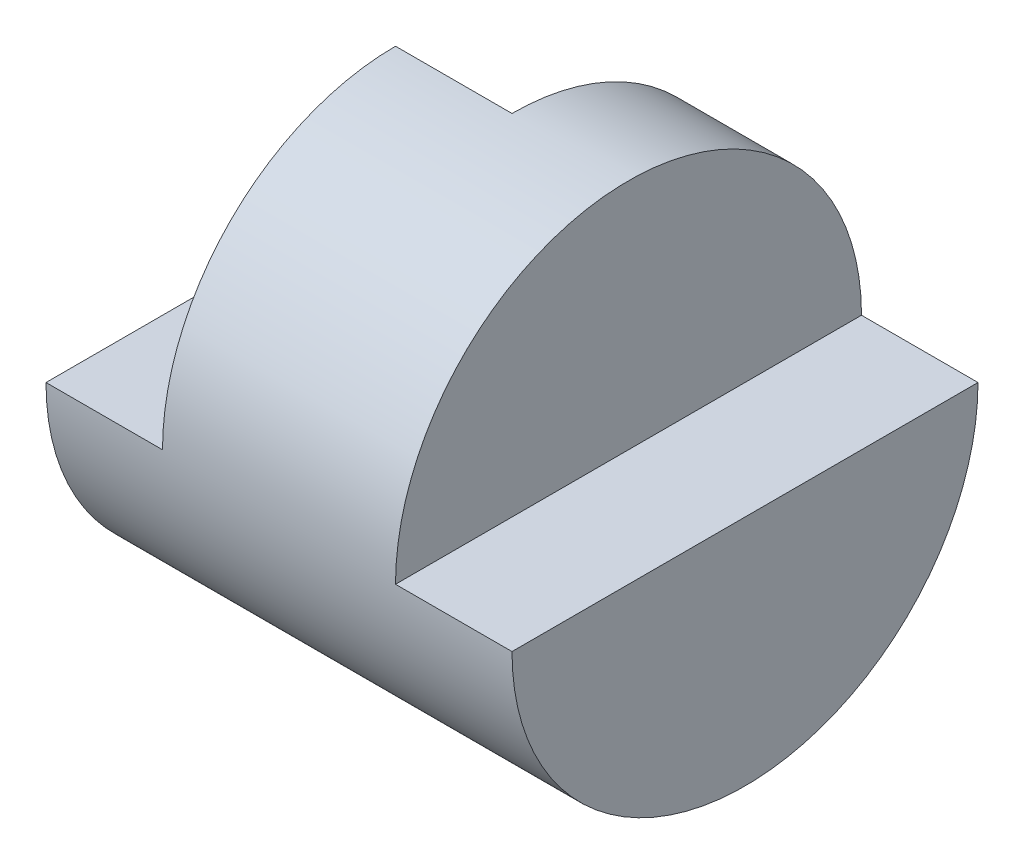
ISO-10303-21;
HEADER;
FILE_DESCRIPTION(('STEP AP214'),'2;1');
FILE_NAME('part.step','',(''),(''),'','','');
FILE_SCHEMA(('AUTOMOTIVE_DESIGN { 1 0 10303 214 1 1 1 1 }'));
ENDSEC;
DATA;
#1=APPLICATION_CONTEXT('core data for automotive mechanical design processes');
#2=APPLICATION_PROTOCOL_DEFINITION('international standard','automotive_design',2000,#1);
#3=PRODUCT_CONTEXT('',#1,'mechanical');
#4=PRODUCT('Part','Part','',(#3));
#5=PRODUCT_RELATED_PRODUCT_CATEGORY('part','',(#4));
#6=PRODUCT_DEFINITION_FORMATION('','',#4);
#7=PRODUCT_DEFINITION_CONTEXT('part definition',#1,'design');
#8=PRODUCT_DEFINITION('design','',#6,#7);
#9=PRODUCT_DEFINITION_SHAPE('','',#8);
#10=(LENGTH_UNIT() NAMED_UNIT(*) SI_UNIT(.MILLI.,.METRE.));
#11=(NAMED_UNIT(*) PLANE_ANGLE_UNIT() SI_UNIT($,.RADIAN.));
#12=(NAMED_UNIT(*) SI_UNIT($,.STERADIAN.) SOLID_ANGLE_UNIT());
#13=UNCERTAINTY_MEASURE_WITH_UNIT(LENGTH_MEASURE(1.E-05),#10,'distance_accuracy_value','');
#14=(GEOMETRIC_REPRESENTATION_CONTEXT(3) GLOBAL_UNCERTAINTY_ASSIGNED_CONTEXT((#13)) GLOBAL_UNIT_ASSIGNED_CONTEXT((#10,
#11,#12)) REPRESENTATION_CONTEXT('',''));
#15=CARTESIAN_POINT('',(0.,0.,0.));
#16=DIRECTION('',(0.,0.,1.));
#17=DIRECTION('',(1.,0.,0.));
#18=AXIS2_PLACEMENT_3D('',#15,#16,#17);
#19=CARTESIAN_POINT('',(0.,0.,0.));
#20=DIRECTION('',(-1.,0.,0.));
#21=DIRECTION('',(0.,0.,1.));
#22=AXIS2_PLACEMENT_3D('',#19,#20,#21);
#23=CYLINDRICAL_SURFACE('',#22,2.);
#24=CARTESIAN_POINT('',(3.,0.,0.));
#25=DIRECTION('',(-1.,0.,0.));
#26=DIRECTION('',(0.,-1.,0.));
#27=AXIS2_PLACEMENT_3D('',#24,#25,#26);
#28=CIRCLE('',#27,2.);
#29=CARTESIAN_POINT('',(3.,0.,-2.));
#30=VERTEX_POINT('',#29);
#31=CARTESIAN_POINT('',(3.,0.,2.));
#32=VERTEX_POINT('',#31);
#33=EDGE_CURVE('E125',#30,#32,#28,.F.);
#34=ORIENTED_EDGE('',*,*,#33,.F.);
#35=DIRECTION('',(-1.,0.,0.));
#36=VECTOR('',#35,1.);
#37=CARTESIAN_POINT('',(0.,0.,-2.));
#38=LINE('',#37,#36);
#39=CARTESIAN_POINT('',(4.,0.,-2.));
#40=VERTEX_POINT('',#39);
#41=EDGE_CURVE('E114',#30,#40,#38,.F.);
#42=ORIENTED_EDGE('',*,*,#41,.T.);
#43=CARTESIAN_POINT('',(4.,0.,0.));
#44=DIRECTION('',(-1.,0.,0.));
#45=DIRECTION('',(0.,0.,1.));
#46=AXIS2_PLACEMENT_3D('',#43,#44,#45);
#47=CIRCLE('',#46,2.);
#48=CARTESIAN_POINT('',(4.,0.,2.));
#49=VERTEX_POINT('',#48);
#50=EDGE_CURVE('E117',#40,#49,#47,.T.);
#51=ORIENTED_EDGE('',*,*,#50,.T.);
#52=DIRECTION('',(-1.,0.,0.));
#53=VECTOR('',#52,1.);
#54=CARTESIAN_POINT('',(0.,0.,2.));
#55=LINE('',#54,#53);
#56=EDGE_CURVE('E54',#49,#32,#55,.T.);
#57=ORIENTED_EDGE('',*,*,#56,.T.);
#58=EDGE_LOOP('',(#34,#42,#51,#57));
#59=FACE_BOUND('',#58,.T.);
#60=CARTESIAN_POINT('',(2.,0.,0.));
#61=DIRECTION('',(-1.,0.,0.));
#62=DIRECTION('',(0.,0.,1.));
#63=AXIS2_PLACEMENT_3D('',#60,#61,#62);
#64=CIRCLE('',#63,2.);
#65=CARTESIAN_POINT('',(2.,0.,-2.));
#66=VERTEX_POINT('',#65);
#67=CARTESIAN_POINT('',(2.,2.,0.));
#68=VERTEX_POINT('',#67);
#69=EDGE_CURVE('E11',#66,#68,#64,.F.);
#70=ORIENTED_EDGE('',*,*,#69,.T.);
#71=DIRECTION('',(-1.,0.,0.));
#72=VECTOR('',#71,1.);
#73=CARTESIAN_POINT('',(0.,2.,0.));
#74=LINE('',#73,#72);
#75=CARTESIAN_POINT('',(1.,2.,0.));
#76=VERTEX_POINT('',#75);
#77=EDGE_CURVE('E101',#68,#76,#74,.T.);
#78=ORIENTED_EDGE('',*,*,#77,.T.);
#79=CARTESIAN_POINT('',(1.,0.,0.));
#80=DIRECTION('',(-1.,0.,0.));
#81=DIRECTION('',(0.,-1.,0.));
#82=AXIS2_PLACEMENT_3D('',#79,#80,#81);
#83=CIRCLE('',#82,2.);
#84=CARTESIAN_POINT('',(1.,0.,2.));
#85=VERTEX_POINT('',#84);
#86=EDGE_CURVE('E39',#76,#85,#83,.F.);
#87=ORIENTED_EDGE('',*,*,#86,.T.);
#88=DIRECTION('',(-1.,0.,0.));
#89=VECTOR('',#88,1.);
#90=CARTESIAN_POINT('',(0.,0.,2.));
#91=LINE('',#90,#89);
#92=CARTESIAN_POINT('',(0.,0.,2.));
#93=VERTEX_POINT('',#92);
#94=EDGE_CURVE('E105',#93,#85,#91,.F.);
#95=ORIENTED_EDGE('',*,*,#94,.F.);
#96=CARTESIAN_POINT('',(0.,0.,0.));
#97=DIRECTION('',(-1.,0.,0.));
#98=DIRECTION('',(0.,0.,1.));
#99=AXIS2_PLACEMENT_3D('',#96,#97,#98);
#100=CIRCLE('',#99,2.);
#101=CARTESIAN_POINT('',(0.,0.,-2.));
#102=VERTEX_POINT('',#101);
#103=EDGE_CURVE('E120',#102,#93,#100,.T.);
#104=ORIENTED_EDGE('',*,*,#103,.F.);
#105=DIRECTION('',(-1.,0.,0.));
#106=VECTOR('',#105,1.);
#107=CARTESIAN_POINT('',(0.,0.,-2.));
#108=LINE('',#107,#106);
#109=EDGE_CURVE('E46',#66,#102,#108,.T.);
#110=ORIENTED_EDGE('',*,*,#109,.F.);
#111=EDGE_LOOP('',(#70,#78,#87,#95,#104,#110));
#112=FACE_BOUND('',#111,.T.);
#113=ADVANCED_FACE('F32',(#59,#112),#23,.T.);
#114=CARTESIAN_POINT('',(1.,0.,-5.5));
#115=DIRECTION('',(-1.,0.,0.));
#116=DIRECTION('',(0.,-1.,0.));
#117=AXIS2_PLACEMENT_3D('',#114,#115,#116);
#118=PLANE('',#117);
#119=ORIENTED_EDGE('',*,*,#86,.F.);
#120=DIRECTION('',(0.,-1.,0.));
#121=VECTOR('',#120,1.);
#122=CARTESIAN_POINT('',(1.,3.,0.));
#123=LINE('',#122,#121);
#124=CARTESIAN_POINT('',(1.,0.,0.));
#125=VERTEX_POINT('',#124);
#126=EDGE_CURVE('E87',#76,#125,#123,.T.);
#127=ORIENTED_EDGE('',*,*,#126,.T.);
#128=DIRECTION('',(0.,0.,1.));
#129=VECTOR('',#128,1.);
#130=CARTESIAN_POINT('',(1.,0.,-5.5));
#131=LINE('',#130,#129);
#132=EDGE_CURVE('E99',#125,#85,#131,.T.);
#133=ORIENTED_EDGE('',*,*,#132,.T.);
#134=EDGE_LOOP('',(#119,#127,#133));
#135=FACE_BOUND('',#134,.T.);
#136=ADVANCED_FACE('F98',(#135),#118,.T.);
#137=CARTESIAN_POINT('',(4.,0.,0.));
#138=DIRECTION('',(-1.,0.,0.));
#139=DIRECTION('',(0.,0.,1.));
#140=AXIS2_PLACEMENT_3D('',#137,#138,#139);
#141=PLANE('',#140);
#142=DIRECTION('',(0.,0.,-1.));
#143=VECTOR('',#142,1.);
#144=CARTESIAN_POINT('',(4.,0.,0.));
#145=LINE('',#144,#143);
#146=EDGE_CURVE('E123',#49,#40,#145,.T.);
#147=ORIENTED_EDGE('',*,*,#146,.F.);
#148=ORIENTED_EDGE('',*,*,#50,.F.);
#149=EDGE_LOOP('',(#147,#148));
#150=FACE_BOUND('',#149,.T.);
#151=ADVANCED_FACE('F146',(#150),#141,.F.);
#152=CARTESIAN_POINT('',(0.,-2.,0.));
#153=DIRECTION('',(1.,0.,0.));
#154=DIRECTION('',(0.,0.,-1.));
#155=AXIS2_PLACEMENT_3D('',#152,#153,#154);
#156=PLANE('',#155);
#157=ORIENTED_EDGE('',*,*,#103,.T.);
#158=DIRECTION('',(0.,0.,-1.));
#159=VECTOR('',#158,1.);
#160=CARTESIAN_POINT('',(0.,0.,0.));
#161=LINE('',#160,#159);
#162=EDGE_CURVE('E127',#93,#102,#161,.T.);
#163=ORIENTED_EDGE('',*,*,#162,.T.);
#164=EDGE_LOOP('',(#157,#163));
#165=FACE_BOUND('',#164,.T.);
#166=ADVANCED_FACE('F161',(#165),#156,.F.);
#167=CARTESIAN_POINT('',(0.,0.,-5.5));
#168=DIRECTION('',(0.,1.,0.));
#169=DIRECTION('',(-1.,0.,0.));
#170=AXIS2_PLACEMENT_3D('',#167,#168,#169);
#171=PLANE('',#170);
#172=DIRECTION('',(0.,0.,1.));
#173=VECTOR('',#172,1.);
#174=CARTESIAN_POINT('',(3.,0.,-5.5));
#175=LINE('',#174,#173);
#176=EDGE_CURVE('E111',#30,#32,#175,.T.);
#177=ORIENTED_EDGE('',*,*,#176,.T.);
#178=ORIENTED_EDGE('',*,*,#56,.F.);
#179=ORIENTED_EDGE('',*,*,#146,.T.);
#180=ORIENTED_EDGE('',*,*,#41,.F.);
#181=EDGE_LOOP('',(#177,#178,#179,#180));
#182=FACE_BOUND('',#181,.T.);
#183=ADVANCED_FACE('F152',(#182),#171,.T.);
#184=CARTESIAN_POINT('',(3.,0.,-5.5));
#185=DIRECTION('',(-1.,0.,0.));
#186=DIRECTION('',(0.,-1.,0.));
#187=AXIS2_PLACEMENT_3D('',#184,#185,#186);
#188=PLANE('',#187);
#189=ORIENTED_EDGE('',*,*,#176,.F.);
#190=ORIENTED_EDGE('',*,*,#33,.T.);
#191=EDGE_LOOP('',(#189,#190));
#192=FACE_BOUND('',#191,.T.);
#193=ADVANCED_FACE('F153',(#192),#188,.F.);
#194=CARTESIAN_POINT('',(0.,0.,-5.5));
#195=DIRECTION('',(0.,-1.,0.));
#196=DIRECTION('',(1.,0.,0.));
#197=AXIS2_PLACEMENT_3D('',#194,#195,#196);
#198=PLANE('',#197);
#199=ORIENTED_EDGE('',*,*,#94,.T.);
#200=ORIENTED_EDGE('',*,*,#132,.F.);
#201=DIRECTION('',(1.,0.,0.));
#202=VECTOR('',#201,1.);
#203=CARTESIAN_POINT('',(1.,0.,0.));
#204=LINE('',#203,#202);
#205=CARTESIAN_POINT('',(2.,0.,0.));
#206=VERTEX_POINT('',#205);
#207=EDGE_CURVE('E84',#125,#206,#204,.T.);
#208=ORIENTED_EDGE('',*,*,#207,.T.);
#209=DIRECTION('',(0.,0.,-1.));
#210=VECTOR('',#209,1.);
#211=CARTESIAN_POINT('',(2.,0.,-2.));
#212=LINE('',#211,#210);
#213=EDGE_CURVE('E93',#206,#66,#212,.T.);
#214=ORIENTED_EDGE('',*,*,#213,.T.);
#215=ORIENTED_EDGE('',*,*,#109,.T.);
#216=ORIENTED_EDGE('',*,*,#162,.F.);
#217=EDGE_LOOP('',(#199,#200,#208,#214,#215,#216));
#218=FACE_BOUND('',#217,.T.);
#219=ADVANCED_FACE('F103',(#218),#198,.F.);
#220=CARTESIAN_POINT('',(1.,3.,0.));
#221=DIRECTION('',(0.,0.,-1.));
#222=DIRECTION('',(-1.,0.,0.));
#223=AXIS2_PLACEMENT_3D('',#220,#221,#222);
#224=PLANE('',#223);
#225=DIRECTION('',(0.,-1.,0.));
#226=VECTOR('',#225,1.);
#227=CARTESIAN_POINT('',(2.,3.,0.));
#228=LINE('',#227,#226);
#229=EDGE_CURVE('E90',#68,#206,#228,.T.);
#230=ORIENTED_EDGE('',*,*,#229,.T.);
#231=ORIENTED_EDGE('',*,*,#207,.F.);
#232=ORIENTED_EDGE('',*,*,#126,.F.);
#233=ORIENTED_EDGE('',*,*,#77,.F.);
#234=EDGE_LOOP('',(#230,#231,#232,#233));
#235=FACE_BOUND('',#234,.T.);
#236=ADVANCED_FACE('F86',(#235),#224,.T.);
#237=CARTESIAN_POINT('',(2.,3.,-2.));
#238=DIRECTION('',(-1.,0.,0.));
#239=DIRECTION('',(0.,0.,1.));
#240=AXIS2_PLACEMENT_3D('',#237,#238,#239);
#241=PLANE('',#240);
#242=ORIENTED_EDGE('',*,*,#213,.F.);
#243=ORIENTED_EDGE('',*,*,#229,.F.);
#244=ORIENTED_EDGE('',*,*,#69,.F.);
#245=EDGE_LOOP('',(#242,#243,#244));
#246=FACE_BOUND('',#245,.T.);
#247=ADVANCED_FACE('F132',(#246),#241,.T.);
#248=CLOSED_SHELL('',(#113,#136,#151,#166,#183,#193,#219,#236,#247));
#249=MANIFOLD_SOLID_BREP('B2',#248);
#250=ADVANCED_BREP_SHAPE_REPRESENTATION('',(#18,#249),#14);
#251=SHAPE_DEFINITION_REPRESENTATION(#9,#250);
ENDSEC;
END-ISO-10303-21;
